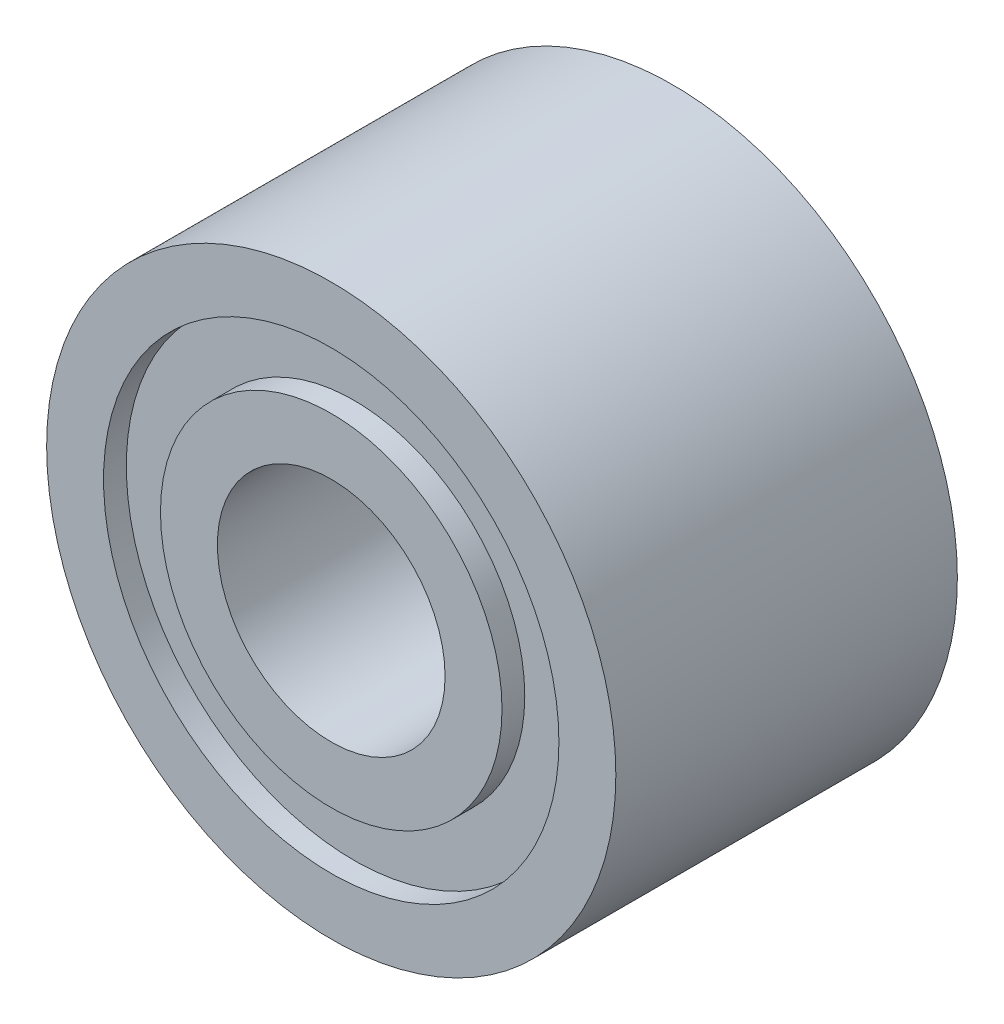
ISO-10303-21;
HEADER;
FILE_DESCRIPTION(('STEP AP214'),'2;1');
FILE_NAME('part.step','',(''),(''),'','','');
FILE_SCHEMA(('AUTOMOTIVE_DESIGN { 1 0 10303 214 1 1 1 1 }'));
ENDSEC;
DATA;
#1=APPLICATION_CONTEXT('core data for automotive mechanical design processes');
#2=APPLICATION_PROTOCOL_DEFINITION('international standard','automotive_design',2000,#1);
#3=PRODUCT_CONTEXT('',#1,'mechanical');
#4=PRODUCT('Part','Part','',(#3));
#5=PRODUCT_RELATED_PRODUCT_CATEGORY('part','',(#4));
#6=PRODUCT_DEFINITION_FORMATION('','',#4);
#7=PRODUCT_DEFINITION_CONTEXT('part definition',#1,'design');
#8=PRODUCT_DEFINITION('design','',#6,#7);
#9=PRODUCT_DEFINITION_SHAPE('','',#8);
#10=(LENGTH_UNIT() NAMED_UNIT(*) SI_UNIT(.MILLI.,.METRE.));
#11=(NAMED_UNIT(*) PLANE_ANGLE_UNIT() SI_UNIT($,.RADIAN.));
#12=(NAMED_UNIT(*) SI_UNIT($,.STERADIAN.) SOLID_ANGLE_UNIT());
#13=UNCERTAINTY_MEASURE_WITH_UNIT(LENGTH_MEASURE(1.E-05),#10,'distance_accuracy_value','');
#14=(GEOMETRIC_REPRESENTATION_CONTEXT(3) GLOBAL_UNCERTAINTY_ASSIGNED_CONTEXT((#13)) GLOBAL_UNIT_ASSIGNED_CONTEXT((#10,
#11,#12)) REPRESENTATION_CONTEXT('',''));
#15=CARTESIAN_POINT('',(0.,0.,0.));
#16=DIRECTION('',(0.,0.,1.));
#17=DIRECTION('',(1.,0.,0.));
#18=AXIS2_PLACEMENT_3D('',#15,#16,#17);
#19=CARTESIAN_POINT('',(0.,2.,-1.10919002990261));
#20=DIRECTION('',(0.,0.,-1.));
#21=DIRECTION('',(-1.,0.,0.));
#22=AXIS2_PLACEMENT_3D('',#19,#20,#21);
#23=PLANE('',#22);
#24=CARTESIAN_POINT('',(0.,0.,-1.10919002990261));
#25=DIRECTION('',(0.,0.,1.));
#26=DIRECTION('',(1.,0.,0.));
#27=AXIS2_PLACEMENT_3D('',#24,#25,#26);
#28=CIRCLE('',#27,2.);
#29=CARTESIAN_POINT('',(2.,0.,-1.10919002990261));
#30=VERTEX_POINT('',#29);
#31=EDGE_CURVE('E90',#30,#30,#28,.T.);
#32=ORIENTED_EDGE('',*,*,#31,.F.);
#33=EDGE_LOOP('',(#32));
#34=FACE_BOUND('',#33,.T.);
#35=CARTESIAN_POINT('',(0.,0.,-1.10919002990261));
#36=DIRECTION('',(0.,0.,1.));
#37=DIRECTION('',(1.,0.,0.));
#38=AXIS2_PLACEMENT_3D('',#35,#36,#37);
#39=CIRCLE('',#38,2.5);
#40=CARTESIAN_POINT('',(2.5,0.,-1.10919002990261));
#41=VERTEX_POINT('',#40);
#42=EDGE_CURVE('E10',#41,#41,#39,.T.);
#43=ORIENTED_EDGE('',*,*,#42,.T.);
#44=EDGE_LOOP('',(#43));
#45=FACE_BOUND('',#44,.T.);
#46=ADVANCED_FACE('F39',(#34,#45),#23,.F.);
#47=CARTESIAN_POINT('',(0.,0.,0.));
#48=DIRECTION('',(0.,0.,1.));
#49=DIRECTION('',(1.,0.,0.));
#50=AXIS2_PLACEMENT_3D('',#47,#48,#49);
#51=CYLINDRICAL_SURFACE('',#50,2.5);
#52=ORIENTED_EDGE('',*,*,#42,.F.);
#53=EDGE_LOOP('',(#52));
#54=FACE_BOUND('',#53,.T.);
#55=CARTESIAN_POINT('',(0.,0.,-4.10919002990261));
#56=DIRECTION('',(0.,0.,1.));
#57=DIRECTION('',(1.,0.,0.));
#58=AXIS2_PLACEMENT_3D('',#55,#56,#57);
#59=CIRCLE('',#58,2.5);
#60=CARTESIAN_POINT('',(2.5,0.,-4.10919002990261));
#61=VERTEX_POINT('',#60);
#62=EDGE_CURVE('E46',#61,#61,#59,.T.);
#63=ORIENTED_EDGE('',*,*,#62,.T.);
#64=EDGE_LOOP('',(#63));
#65=FACE_BOUND('',#64,.T.);
#66=ADVANCED_FACE('F98',(#54,#65),#51,.T.);
#67=CARTESIAN_POINT('',(0.,2.5,-4.10919002990261));
#68=DIRECTION('',(0.,0.,1.));
#69=DIRECTION('',(1.,0.,0.));
#70=AXIS2_PLACEMENT_3D('',#67,#68,#69);
#71=PLANE('',#70);
#72=ORIENTED_EDGE('',*,*,#62,.F.);
#73=EDGE_LOOP('',(#72));
#74=FACE_BOUND('',#73,.T.);
#75=CARTESIAN_POINT('',(0.,0.,-4.10919002990261));
#76=DIRECTION('',(0.,0.,1.));
#77=DIRECTION('',(1.,0.,0.));
#78=AXIS2_PLACEMENT_3D('',#75,#76,#77);
#79=CIRCLE('',#78,2.);
#80=CARTESIAN_POINT('',(2.,0.,-4.10919002990261));
#81=VERTEX_POINT('',#80);
#82=EDGE_CURVE('E51',#81,#81,#79,.T.);
#83=ORIENTED_EDGE('',*,*,#82,.T.);
#84=EDGE_LOOP('',(#83));
#85=FACE_BOUND('',#84,.T.);
#86=ADVANCED_FACE('F102',(#74,#85),#71,.F.);
#87=CARTESIAN_POINT('',(0.,0.,0.));
#88=DIRECTION('',(0.,0.,1.));
#89=DIRECTION('',(1.,0.,0.));
#90=AXIS2_PLACEMENT_3D('',#87,#88,#89);
#91=CYLINDRICAL_SURFACE('',#90,2.);
#92=ORIENTED_EDGE('',*,*,#82,.F.);
#93=EDGE_LOOP('',(#92));
#94=FACE_BOUND('',#93,.T.);
#95=CARTESIAN_POINT('',(0.,0.,-3.90919002990261));
#96=DIRECTION('',(0.,0.,1.));
#97=DIRECTION('',(1.,0.,0.));
#98=AXIS2_PLACEMENT_3D('',#95,#96,#97);
#99=CIRCLE('',#98,2.);
#100=CARTESIAN_POINT('',(2.,0.,-3.90919002990261));
#101=VERTEX_POINT('',#100);
#102=EDGE_CURVE('E56',#101,#101,#99,.T.);
#103=ORIENTED_EDGE('',*,*,#102,.T.);
#104=EDGE_LOOP('',(#103));
#105=FACE_BOUND('',#104,.T.);
#106=ADVANCED_FACE('F107',(#94,#105),#91,.F.);
#107=CARTESIAN_POINT('',(0.,2.,-3.90919002990261));
#108=DIRECTION('',(0.,0.,1.));
#109=DIRECTION('',(1.,0.,0.));
#110=AXIS2_PLACEMENT_3D('',#107,#108,#109);
#111=PLANE('',#110);
#112=ORIENTED_EDGE('',*,*,#102,.F.);
#113=EDGE_LOOP('',(#112));
#114=FACE_BOUND('',#113,.T.);
#115=CARTESIAN_POINT('',(0.,0.,-3.90919002990261));
#116=DIRECTION('',(0.,0.,1.));
#117=DIRECTION('',(1.,0.,0.));
#118=AXIS2_PLACEMENT_3D('',#115,#116,#117);
#119=CIRCLE('',#118,1.5);
#120=CARTESIAN_POINT('',(1.5,0.,-3.90919002990261));
#121=VERTEX_POINT('',#120);
#122=EDGE_CURVE('E62',#121,#121,#119,.T.);
#123=ORIENTED_EDGE('',*,*,#122,.T.);
#124=EDGE_LOOP('',(#123));
#125=FACE_BOUND('',#124,.T.);
#126=ADVANCED_FACE('F113',(#114,#125),#111,.F.);
#127=CARTESIAN_POINT('',(0.,0.,0.));
#128=DIRECTION('',(0.,0.,1.));
#129=DIRECTION('',(1.,0.,0.));
#130=AXIS2_PLACEMENT_3D('',#127,#128,#129);
#131=CYLINDRICAL_SURFACE('',#130,1.5);
#132=ORIENTED_EDGE('',*,*,#122,.F.);
#133=EDGE_LOOP('',(#132));
#134=FACE_BOUND('',#133,.T.);
#135=CARTESIAN_POINT('',(0.,0.,-4.10919002990261));
#136=DIRECTION('',(0.,0.,1.));
#137=DIRECTION('',(1.,0.,0.));
#138=AXIS2_PLACEMENT_3D('',#135,#136,#137);
#139=CIRCLE('',#138,1.5);
#140=CARTESIAN_POINT('',(1.5,0.,-4.10919002990261));
#141=VERTEX_POINT('',#140);
#142=EDGE_CURVE('E66',#141,#141,#139,.T.);
#143=ORIENTED_EDGE('',*,*,#142,.T.);
#144=EDGE_LOOP('',(#143));
#145=FACE_BOUND('',#144,.T.);
#146=ADVANCED_FACE('F117',(#134,#145),#131,.T.);
#147=CARTESIAN_POINT('',(0.,1.5,-4.10919002990261));
#148=DIRECTION('',(0.,0.,1.));
#149=DIRECTION('',(1.,0.,0.));
#150=AXIS2_PLACEMENT_3D('',#147,#148,#149);
#151=PLANE('',#150);
#152=ORIENTED_EDGE('',*,*,#142,.F.);
#153=EDGE_LOOP('',(#152));
#154=FACE_BOUND('',#153,.T.);
#155=CARTESIAN_POINT('',(0.,0.,-4.10919002990261));
#156=DIRECTION('',(0.,0.,1.));
#157=DIRECTION('',(1.,0.,0.));
#158=AXIS2_PLACEMENT_3D('',#155,#156,#157);
#159=CIRCLE('',#158,1.);
#160=CARTESIAN_POINT('',(1.,0.,-4.10919002990261));
#161=VERTEX_POINT('',#160);
#162=EDGE_CURVE('E70',#161,#161,#159,.T.);
#163=ORIENTED_EDGE('',*,*,#162,.T.);
#164=EDGE_LOOP('',(#163));
#165=FACE_BOUND('',#164,.T.);
#166=ADVANCED_FACE('F121',(#154,#165),#151,.F.);
#167=CARTESIAN_POINT('',(0.,0.,0.));
#168=DIRECTION('',(0.,0.,1.));
#169=DIRECTION('',(1.,0.,0.));
#170=AXIS2_PLACEMENT_3D('',#167,#168,#169);
#171=CYLINDRICAL_SURFACE('',#170,1.);
#172=ORIENTED_EDGE('',*,*,#162,.F.);
#173=EDGE_LOOP('',(#172));
#174=FACE_BOUND('',#173,.T.);
#175=CARTESIAN_POINT('',(0.,0.,-1.10919002990261));
#176=DIRECTION('',(0.,0.,1.));
#177=DIRECTION('',(1.,0.,0.));
#178=AXIS2_PLACEMENT_3D('',#175,#176,#177);
#179=CIRCLE('',#178,1.);
#180=CARTESIAN_POINT('',(1.,0.,-1.10919002990261));
#181=VERTEX_POINT('',#180);
#182=EDGE_CURVE('E74',#181,#181,#179,.T.);
#183=ORIENTED_EDGE('',*,*,#182,.T.);
#184=EDGE_LOOP('',(#183));
#185=FACE_BOUND('',#184,.T.);
#186=ADVANCED_FACE('F125',(#174,#185),#171,.F.);
#187=CARTESIAN_POINT('',(0.,1.,-1.10919002990261));
#188=DIRECTION('',(0.,0.,-1.));
#189=DIRECTION('',(-1.,0.,0.));
#190=AXIS2_PLACEMENT_3D('',#187,#188,#189);
#191=PLANE('',#190);
#192=ORIENTED_EDGE('',*,*,#182,.F.);
#193=EDGE_LOOP('',(#192));
#194=FACE_BOUND('',#193,.T.);
#195=CARTESIAN_POINT('',(0.,0.,-1.10919002990261));
#196=DIRECTION('',(0.,0.,1.));
#197=DIRECTION('',(1.,0.,0.));
#198=AXIS2_PLACEMENT_3D('',#195,#196,#197);
#199=CIRCLE('',#198,1.5);
#200=CARTESIAN_POINT('',(1.5,0.,-1.10919002990261));
#201=VERTEX_POINT('',#200);
#202=EDGE_CURVE('E78',#201,#201,#199,.T.);
#203=ORIENTED_EDGE('',*,*,#202,.T.);
#204=EDGE_LOOP('',(#203));
#205=FACE_BOUND('',#204,.T.);
#206=ADVANCED_FACE('F129',(#194,#205),#191,.F.);
#207=CARTESIAN_POINT('',(0.,0.,0.));
#208=DIRECTION('',(0.,0.,1.));
#209=DIRECTION('',(1.,0.,0.));
#210=AXIS2_PLACEMENT_3D('',#207,#208,#209);
#211=CYLINDRICAL_SURFACE('',#210,1.5);
#212=ORIENTED_EDGE('',*,*,#202,.F.);
#213=EDGE_LOOP('',(#212));
#214=FACE_BOUND('',#213,.T.);
#215=CARTESIAN_POINT('',(0.,0.,-1.30919002990261));
#216=DIRECTION('',(0.,0.,1.));
#217=DIRECTION('',(1.,0.,0.));
#218=AXIS2_PLACEMENT_3D('',#215,#216,#217);
#219=CIRCLE('',#218,1.5);
#220=CARTESIAN_POINT('',(1.5,0.,-1.30919002990261));
#221=VERTEX_POINT('',#220);
#222=EDGE_CURVE('E82',#221,#221,#219,.T.);
#223=ORIENTED_EDGE('',*,*,#222,.T.);
#224=EDGE_LOOP('',(#223));
#225=FACE_BOUND('',#224,.T.);
#226=ADVANCED_FACE('F133',(#214,#225),#211,.T.);
#227=CARTESIAN_POINT('',(0.,1.5,-1.30919002990261));
#228=DIRECTION('',(0.,0.,-1.));
#229=DIRECTION('',(-1.,0.,0.));
#230=AXIS2_PLACEMENT_3D('',#227,#228,#229);
#231=PLANE('',#230);
#232=ORIENTED_EDGE('',*,*,#222,.F.);
#233=EDGE_LOOP('',(#232));
#234=FACE_BOUND('',#233,.T.);
#235=CARTESIAN_POINT('',(0.,0.,-1.30919002990261));
#236=DIRECTION('',(0.,0.,1.));
#237=DIRECTION('',(1.,0.,0.));
#238=AXIS2_PLACEMENT_3D('',#235,#236,#237);
#239=CIRCLE('',#238,2.);
#240=CARTESIAN_POINT('',(2.,0.,-1.30919002990261));
#241=VERTEX_POINT('',#240);
#242=EDGE_CURVE('E86',#241,#241,#239,.T.);
#243=ORIENTED_EDGE('',*,*,#242,.T.);
#244=EDGE_LOOP('',(#243));
#245=FACE_BOUND('',#244,.T.);
#246=ADVANCED_FACE('F137',(#234,#245),#231,.F.);
#247=CARTESIAN_POINT('',(0.,0.,0.));
#248=DIRECTION('',(0.,0.,1.));
#249=DIRECTION('',(1.,0.,0.));
#250=AXIS2_PLACEMENT_3D('',#247,#248,#249);
#251=CYLINDRICAL_SURFACE('',#250,2.);
#252=ORIENTED_EDGE('',*,*,#242,.F.);
#253=EDGE_LOOP('',(#252));
#254=FACE_BOUND('',#253,.T.);
#255=ORIENTED_EDGE('',*,*,#31,.T.);
#256=EDGE_LOOP('',(#255));
#257=FACE_BOUND('',#256,.T.);
#258=ADVANCED_FACE('F95',(#254,#257),#251,.F.);
#259=CLOSED_SHELL('',(#46,#66,#86,#106,#126,#146,#166,#186,#206,#226,#246,#258));
#260=MANIFOLD_SOLID_BREP('B2',#259);
#261=ADVANCED_BREP_SHAPE_REPRESENTATION('',(#18,#260),#14);
#262=SHAPE_DEFINITION_REPRESENTATION(#9,#261);
ENDSEC;
END-ISO-10303-21;
